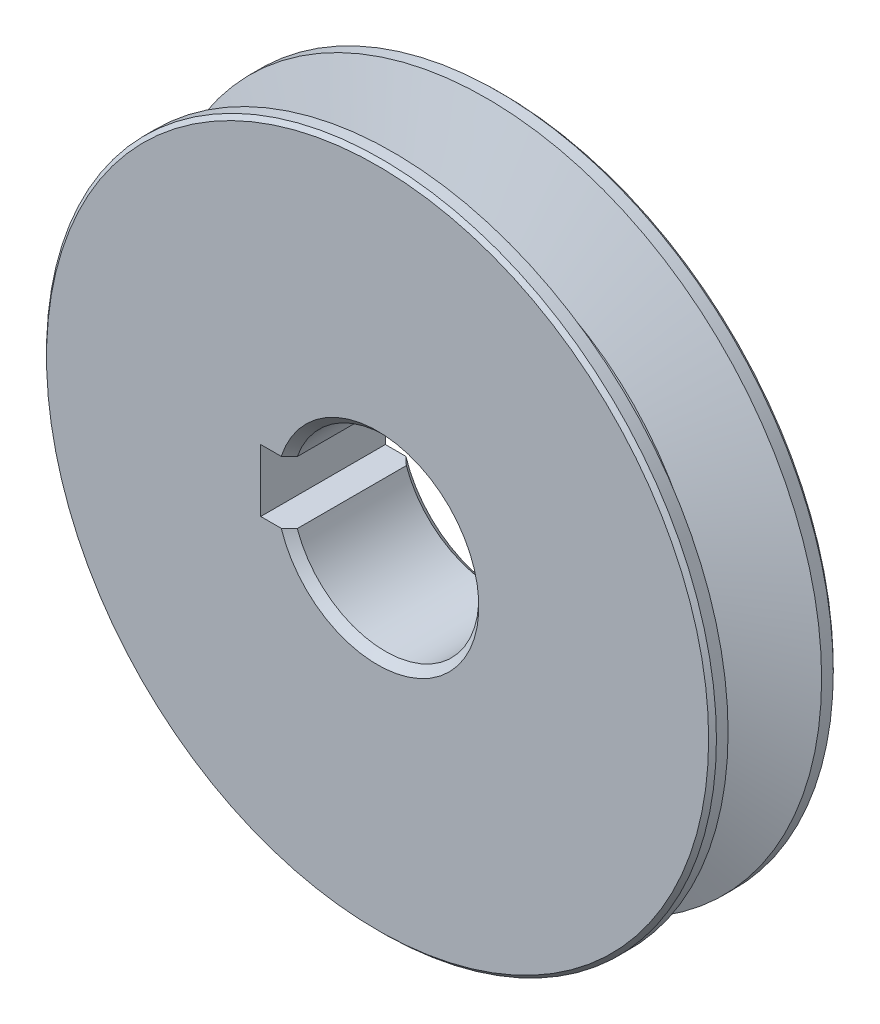
ISO-10303-21;
HEADER;
FILE_DESCRIPTION(('STEP AP214'),'2;1');
FILE_NAME('part.step','',(''),(''),'','','');
FILE_SCHEMA(('AUTOMOTIVE_DESIGN { 1 0 10303 214 1 1 1 1 }'));
ENDSEC;
DATA;
#1=APPLICATION_CONTEXT('core data for automotive mechanical design processes');
#2=APPLICATION_PROTOCOL_DEFINITION('international standard','automotive_design',2000,#1);
#3=PRODUCT_CONTEXT('',#1,'mechanical');
#4=PRODUCT('Part','Part','',(#3));
#5=PRODUCT_RELATED_PRODUCT_CATEGORY('part','',(#4));
#6=PRODUCT_DEFINITION_FORMATION('','',#4);
#7=PRODUCT_DEFINITION_CONTEXT('part definition',#1,'design');
#8=PRODUCT_DEFINITION('design','',#6,#7);
#9=PRODUCT_DEFINITION_SHAPE('','',#8);
#10=(LENGTH_UNIT() NAMED_UNIT(*) SI_UNIT(.MILLI.,.METRE.));
#11=(NAMED_UNIT(*) PLANE_ANGLE_UNIT() SI_UNIT($,.RADIAN.));
#12=(NAMED_UNIT(*) SI_UNIT($,.STERADIAN.) SOLID_ANGLE_UNIT());
#13=UNCERTAINTY_MEASURE_WITH_UNIT(LENGTH_MEASURE(1.E-05),#10,'distance_accuracy_value','');
#14=(GEOMETRIC_REPRESENTATION_CONTEXT(3) GLOBAL_UNCERTAINTY_ASSIGNED_CONTEXT((#13)) GLOBAL_UNIT_ASSIGNED_CONTEXT((#10,
#11,#12)) REPRESENTATION_CONTEXT('',''));
#15=CARTESIAN_POINT('',(0.,0.,0.));
#16=DIRECTION('',(0.,0.,1.));
#17=DIRECTION('',(1.,0.,0.));
#18=AXIS2_PLACEMENT_3D('',#15,#16,#17);
#19=CARTESIAN_POINT('',(0.02123051128702,9.01009597848504E-13,-5.99999999999978));
#20=DIRECTION('',(0.,0.,1.));
#21=DIRECTION('',(1.,0.,0.));
#22=AXIS2_PLACEMENT_3D('',#19,#20,#21);
#23=CYLINDRICAL_SURFACE('',#22,32.25);
#24=CARTESIAN_POINT('',(0.0212305112870201,9.01009597848504E-13,-5.62499999999969));
#25=DIRECTION('',(0.,0.,-1.));
#26=DIRECTION('',(-1.,0.,0.));
#27=AXIS2_PLACEMENT_3D('',#24,#25,#26);
#28=CIRCLE('',#27,32.25);
#29=CARTESIAN_POINT('',(-32.228769488713,9.01009597848504E-13,-5.62499999999969));
#30=VERTEX_POINT('',#29);
#31=EDGE_CURVE('E43',#30,#30,#28,.F.);
#32=ORIENTED_EDGE('',*,*,#31,.T.);
#33=EDGE_LOOP('',(#32));
#34=FACE_BOUND('',#33,.T.);
#35=CARTESIAN_POINT('',(0.0212305112870202,9.01009597848504E-13,-4.50275443269578));
#36=DIRECTION('',(0.,0.,1.));
#37=DIRECTION('',(1.,0.,0.));
#38=AXIS2_PLACEMENT_3D('',#35,#36,#37);
#39=CIRCLE('',#38,32.25);
#40=CARTESIAN_POINT('',(32.271230511287,9.01009597848504E-13,-4.50275443269578));
#41=VERTEX_POINT('',#40);
#42=EDGE_CURVE('E121',#41,#41,#39,.T.);
#43=ORIENTED_EDGE('',*,*,#42,.F.);
#44=EDGE_LOOP('',(#43));
#45=FACE_BOUND('',#44,.T.);
#46=ADVANCED_FACE('F35',(#34,#45),#23,.T.);
#47=CARTESIAN_POINT('',(32.271230511287,9.01009597848504E-13,-5.99999999999979));
#48=DIRECTION('',(0.,0.,-1.));
#49=DIRECTION('',(-1.,0.,0.));
#50=AXIS2_PLACEMENT_3D('',#47,#48,#49);
#51=PLANE('',#50);
#52=CARTESIAN_POINT('',(0.02123051128702,9.01009597848504E-13,-5.99999999999978));
#53=DIRECTION('',(0.,0.,-1.));
#54=DIRECTION('',(-1.,0.,0.));
#55=AXIS2_PLACEMENT_3D('',#52,#53,#54);
#56=CIRCLE('',#55,31.875);
#57=CARTESIAN_POINT('',(-31.853769488713,9.01009597848504E-13,-5.99999999999978));
#58=VERTEX_POINT('',#57);
#59=EDGE_CURVE('E11',#58,#58,#56,.T.);
#60=ORIENTED_EDGE('',*,*,#59,.T.);
#61=EDGE_LOOP('',(#60));
#62=FACE_BOUND('',#61,.T.);
#63=DIRECTION('',(1.,0.,0.));
#64=VECTOR('',#63,1.);
#65=CARTESIAN_POINT('',(-11.2287694887134,-2.9999999999991,-5.99999999999978));
#66=LINE('',#65,#64);
#67=CARTESIAN_POINT('',(-11.2287694887134,-2.9999999999991,-5.99999999999978));
#68=VERTEX_POINT('',#67);
#69=CARTESIAN_POINT('',(-9.25575716274696,-2.9999999999991,-5.99999999999978));
#70=VERTEX_POINT('',#69);
#71=EDGE_CURVE('E102',#68,#70,#66,.T.);
#72=ORIENTED_EDGE('',*,*,#71,.T.);
#73=CARTESIAN_POINT('',(0.0212305112866469,9.01009597848504E-13,-5.99999999999978));
#74=DIRECTION('',(0.,0.,-1.));
#75=DIRECTION('',(-1.,0.,0.));
#76=AXIS2_PLACEMENT_3D('',#73,#74,#75);
#77=CIRCLE('',#76,9.75000001559854);
#78=CARTESIAN_POINT('',(-9.25575716298804,2.9999999992554,-5.99999999999978));
#79=VERTEX_POINT('',#78);
#80=EDGE_CURVE('E181',#70,#79,#77,.F.);
#81=ORIENTED_EDGE('',*,*,#80,.T.);
#82=DIRECTION('',(-1.,0.,0.));
#83=VECTOR('',#82,1.);
#84=CARTESIAN_POINT('',(-8.4640508632155,2.9999999992554,-5.99999999999978));
#85=LINE('',#84,#83);
#86=CARTESIAN_POINT('',(-11.2287694887134,2.9999999992554,-5.99999999999978));
#87=VERTEX_POINT('',#86);
#88=EDGE_CURVE('E100',#79,#87,#85,.T.);
#89=ORIENTED_EDGE('',*,*,#88,.T.);
#90=DIRECTION('',(0.,-1.,0.));
#91=VECTOR('',#90,1.);
#92=CARTESIAN_POINT('',(-11.2287694887134,2.9999999992554,-5.99999999999978));
#93=LINE('',#92,#91);
#94=EDGE_CURVE('E96',#87,#68,#93,.T.);
#95=ORIENTED_EDGE('',*,*,#94,.T.);
#96=EDGE_LOOP('',(#72,#81,#89,#95));
#97=FACE_BOUND('',#96,.T.);
#98=ADVANCED_FACE('F108',(#62,#97),#51,.T.);
#99=CARTESIAN_POINT('',(0.0212305112870215,9.01009597848504E-13,6.00000000000022));
#100=DIRECTION('',(0.,0.,1.));
#101=DIRECTION('',(1.,0.,0.));
#102=AXIS2_PLACEMENT_3D('',#99,#100,#101);
#103=PLANE('',#102);
#104=CARTESIAN_POINT('',(0.0212305112870215,9.01009597848504E-13,6.00000000000022));
#105=DIRECTION('',(0.,0.,1.));
#106=DIRECTION('',(1.,0.,0.));
#107=AXIS2_PLACEMENT_3D('',#104,#105,#106);
#108=CIRCLE('',#107,31.8749999999999);
#109=CARTESIAN_POINT('',(31.8962305112869,9.01009597848504E-13,6.00000000000022));
#110=VERTEX_POINT('',#109);
#111=EDGE_CURVE('E328',#110,#110,#108,.T.);
#112=ORIENTED_EDGE('',*,*,#111,.T.);
#113=EDGE_LOOP('',(#112));
#114=FACE_BOUND('',#113,.T.);
#115=DIRECTION('',(-1.,0.,0.));
#116=VECTOR('',#115,1.);
#117=CARTESIAN_POINT('',(-8.4640508632155,2.9999999992554,6.00000000000022));
#118=LINE('',#117,#116);
#119=CARTESIAN_POINT('',(-9.2557571609674,2.9999999992554,6.00000000000022));
#120=VERTEX_POINT('',#119);
#121=CARTESIAN_POINT('',(-11.2287694887134,2.9999999992554,6.00000000000022));
#122=VERTEX_POINT('',#121);
#123=EDGE_CURVE('E111',#120,#122,#118,.T.);
#124=ORIENTED_EDGE('',*,*,#123,.F.);
#125=CARTESIAN_POINT('',(0.0212305112866469,9.01009597848504E-13,6.00000000000022));
#126=DIRECTION('',(0.,0.,1.));
#127=DIRECTION('',(1.,0.,0.));
#128=AXIS2_PLACEMENT_3D('',#125,#126,#127);
#129=CIRCLE('',#128,9.75000001367592);
#130=CARTESIAN_POINT('',(-9.25575716072631,-2.9999999999991,6.00000000000022));
#131=VERTEX_POINT('',#130);
#132=EDGE_CURVE('E58',#120,#131,#129,.F.);
#133=ORIENTED_EDGE('',*,*,#132,.T.);
#134=DIRECTION('',(1.,0.,0.));
#135=VECTOR('',#134,1.);
#136=CARTESIAN_POINT('',(-11.2287694887134,-2.9999999999991,6.00000000000022));
#137=LINE('',#136,#135);
#138=CARTESIAN_POINT('',(-11.2287694887134,-2.9999999999991,6.00000000000022));
#139=VERTEX_POINT('',#138);
#140=EDGE_CURVE('E113',#139,#131,#137,.T.);
#141=ORIENTED_EDGE('',*,*,#140,.F.);
#142=DIRECTION('',(0.,-1.,0.));
#143=VECTOR('',#142,1.);
#144=CARTESIAN_POINT('',(-11.2287694887134,2.9999999992554,6.00000000000022));
#145=LINE('',#144,#143);
#146=EDGE_CURVE('E98',#122,#139,#145,.T.);
#147=ORIENTED_EDGE('',*,*,#146,.F.);
#148=EDGE_LOOP('',(#124,#133,#141,#147));
#149=FACE_BOUND('',#148,.T.);
#150=ADVANCED_FACE('F194',(#114,#149),#103,.T.);
#151=CARTESIAN_POINT('',(0.02123051128702,9.01009597848504E-13,-5.99999999999978));
#152=DIRECTION('',(0.,0.,1.));
#153=DIRECTION('',(1.,0.,0.));
#154=AXIS2_PLACEMENT_3D('',#151,#152,#153);
#155=CYLINDRICAL_SURFACE('',#154,32.25);
#156=CARTESIAN_POINT('',(0.0212305112870214,9.01009597848504E-13,5.62500000000025));
#157=DIRECTION('',(0.,0.,1.));
#158=DIRECTION('',(1.,0.,0.));
#159=AXIS2_PLACEMENT_3D('',#156,#157,#158);
#160=CIRCLE('',#159,32.25);
#161=CARTESIAN_POINT('',(32.271230511287,9.01009597848504E-13,5.62500000000025));
#162=VERTEX_POINT('',#161);
#163=EDGE_CURVE('E326',#162,#162,#160,.F.);
#164=ORIENTED_EDGE('',*,*,#163,.T.);
#165=EDGE_LOOP('',(#164));
#166=FACE_BOUND('',#165,.T.);
#167=CARTESIAN_POINT('',(0.0212305112870213,9.01009597848504E-13,4.50275443269622));
#168=DIRECTION('',(0.,0.,1.));
#169=DIRECTION('',(1.,0.,0.));
#170=AXIS2_PLACEMENT_3D('',#167,#168,#169);
#171=CIRCLE('',#170,32.25);
#172=CARTESIAN_POINT('',(32.271230511287,9.01009597848504E-13,4.50275443269622));
#173=VERTEX_POINT('',#172);
#174=EDGE_CURVE('E135',#173,#173,#171,.T.);
#175=ORIENTED_EDGE('',*,*,#174,.T.);
#176=EDGE_LOOP('',(#175));
#177=FACE_BOUND('',#176,.T.);
#178=ADVANCED_FACE('F198',(#166,#177),#155,.T.);
#179=CARTESIAN_POINT('',(0.0212305112870213,9.01009597848504E-13,4.50275443269622));
#180=DIRECTION('',(0.,0.,1.));
#181=DIRECTION('',(1.,0.,0.));
#182=AXIS2_PLACEMENT_3D('',#179,#180,#181);
#183=CONICAL_SURFACE('',#182,32.25,1.22173047639594);
#184=CARTESIAN_POINT('',(0.0212305112870209,9.01009597848504E-13,1.4999999999992));
#185=DIRECTION('',(0.,0.,1.));
#186=DIRECTION('',(1.,0.,0.));
#187=AXIS2_PLACEMENT_3D('',#184,#185,#186);
#188=CIRCLE('',#187,24.);
#189=CARTESIAN_POINT('',(24.021230511287,9.01009597848504E-13,1.49999999999919));
#190=VERTEX_POINT('',#189);
#191=EDGE_CURVE('E132',#190,#190,#188,.T.);
#192=ORIENTED_EDGE('',*,*,#191,.T.);
#193=EDGE_LOOP('',(#192));
#194=FACE_BOUND('',#193,.T.);
#195=ORIENTED_EDGE('',*,*,#174,.F.);
#196=EDGE_LOOP('',(#195));
#197=FACE_BOUND('',#196,.T.);
#198=ADVANCED_FACE('F202',(#194,#197),#183,.T.);
#199=CARTESIAN_POINT('',(0.02123051128702,9.01009597848504E-13,-5.99999999999978));
#200=DIRECTION('',(0.,0.,1.));
#201=DIRECTION('',(1.,0.,0.));
#202=AXIS2_PLACEMENT_3D('',#199,#200,#201);
#203=CYLINDRICAL_SURFACE('',#202,24.);
#204=CARTESIAN_POINT('',(0.0212305112870206,9.01009597848504E-13,-1.49999999999978));
#205=DIRECTION('',(0.,0.,1.));
#206=DIRECTION('',(1.,0.,0.));
#207=AXIS2_PLACEMENT_3D('',#204,#205,#206);
#208=CIRCLE('',#207,24.);
#209=CARTESIAN_POINT('',(24.021230511287,9.01009597848504E-13,-1.49999999999978));
#210=VERTEX_POINT('',#209);
#211=EDGE_CURVE('E129',#210,#210,#208,.T.);
#212=ORIENTED_EDGE('',*,*,#211,.T.);
#213=EDGE_LOOP('',(#212));
#214=FACE_BOUND('',#213,.T.);
#215=ORIENTED_EDGE('',*,*,#191,.F.);
#216=EDGE_LOOP('',(#215));
#217=FACE_BOUND('',#216,.T.);
#218=ADVANCED_FACE('F206',(#214,#217),#203,.T.);
#219=CARTESIAN_POINT('',(0.0212305112870206,9.01009597848504E-13,-1.49999999999978));
#220=DIRECTION('',(0.,0.,-1.));
#221=DIRECTION('',(-1.,0.,0.));
#222=AXIS2_PLACEMENT_3D('',#219,#220,#221);
#223=CONICAL_SURFACE('',#222,24.,1.22173047639605);
#224=ORIENTED_EDGE('',*,*,#42,.T.);
#225=EDGE_LOOP('',(#224));
#226=FACE_BOUND('',#225,.T.);
#227=ORIENTED_EDGE('',*,*,#211,.F.);
#228=EDGE_LOOP('',(#227));
#229=FACE_BOUND('',#228,.T.);
#230=ADVANCED_FACE('F209',(#226,#229),#223,.T.);
#231=CARTESIAN_POINT('',(-11.2287694887134,2.9999999992554,-5.99999999999978));
#232=DIRECTION('',(-1.,0.,0.));
#233=DIRECTION('',(0.,0.,1.));
#234=AXIS2_PLACEMENT_3D('',#231,#232,#233);
#235=PLANE('',#234);
#236=ORIENTED_EDGE('',*,*,#146,.T.);
#237=DIRECTION('',(0.,0.,1.));
#238=VECTOR('',#237,1.);
#239=CARTESIAN_POINT('',(-11.2287694887134,-2.9999999999991,-5.99999999999978));
#240=LINE('',#239,#238);
#241=EDGE_CURVE('E92',#68,#139,#240,.T.);
#242=ORIENTED_EDGE('',*,*,#241,.F.);
#243=ORIENTED_EDGE('',*,*,#94,.F.);
#244=DIRECTION('',(0.,0.,1.));
#245=VECTOR('',#244,1.);
#246=CARTESIAN_POINT('',(-11.2287694887134,2.9999999992554,-5.99999999999978));
#247=LINE('',#246,#245);
#248=EDGE_CURVE('E119',#87,#122,#247,.T.);
#249=ORIENTED_EDGE('',*,*,#248,.T.);
#250=EDGE_LOOP('',(#236,#242,#243,#249));
#251=FACE_BOUND('',#250,.T.);
#252=ADVANCED_FACE('F93',(#251),#235,.F.);
#253=CARTESIAN_POINT('',(-8.4640508632155,2.9999999992554,-5.99999999999978));
#254=DIRECTION('',(0.,1.,0.));
#255=DIRECTION('',(0.,0.,1.));
#256=AXIS2_PLACEMENT_3D('',#253,#254,#255);
#257=PLANE('',#256);
#258=DIRECTION('',(0.,0.,1.));
#259=VECTOR('',#258,1.);
#260=CARTESIAN_POINT('',(-8.46405086321549,2.9999999992554,-5.99999999999978));
#261=LINE('',#260,#259);
#262=CARTESIAN_POINT('',(-8.46405086321549,2.9999999992554,-5.24999998632386));
#263=VERTEX_POINT('',#262);
#264=CARTESIAN_POINT('',(-8.46405086321549,2.9999999992554,5.24999998440168));
#265=VERTEX_POINT('',#264);
#266=EDGE_CURVE('E122',#263,#265,#261,.T.);
#267=ORIENTED_EDGE('',*,*,#266,.T.);
#268=CARTESIAN_POINT('',(-8.4640508632155,2.9999999992554,5.24999998440168));
#269=CARTESIAN_POINT('',(-8.59628727510804,2.9999999992554,5.37469876997658));
#270=CARTESIAN_POINT('',(-8.72838100929807,2.9999999992554,5.49954816732916));
#271=CARTESIAN_POINT('',(-8.99228310851896,2.9999999992554,5.74954817256007));
#272=CARTESIAN_POINT('',(-9.12409147357956,2.9999999992554,5.874698780407));
#273=CARTESIAN_POINT('',(-9.2557571609674,2.9999999992554,6.00000000000022));
#274=B_SPLINE_CURVE_WITH_KNOTS('',3,(#268,#269,#270,#271,#272,#273),.UNSPECIFIED.,.F.,.F.,(4,2,
4),(0.,0.545275287982242,1.09055051912671),.UNSPECIFIED.);
#275=EDGE_CURVE('E150',#265,#120,#274,.T.);
#276=ORIENTED_EDGE('',*,*,#275,.T.);
#277=ORIENTED_EDGE('',*,*,#123,.T.);
#278=ORIENTED_EDGE('',*,*,#248,.F.);
#279=ORIENTED_EDGE('',*,*,#88,.F.);
#280=CARTESIAN_POINT('',(-9.25575716298804,2.9999999992554,-5.99999999999978));
#281=CARTESIAN_POINT('',(-9.12409147526326,2.9999999992554,-5.87469878072564));
#282=CARTESIAN_POINT('',(-8.9922831098658,2.9999999992554,-5.74954817319845));
#283=CARTESIAN_POINT('',(-8.72838100997136,2.9999999992554,-5.49954816860841));
#284=CARTESIAN_POINT('',(-8.59628727544464,2.9999999992554,-5.37469877157695));
#285=CARTESIAN_POINT('',(-8.4640508632155,2.9999999992554,-5.24999998632386));
#286=B_SPLINE_CURVE_WITH_KNOTS('',3,(#280,#281,#282,#283,#284,#285),.UNSPECIFIED.,.F.,.F.,(4,2,
4),(0.,0.545275231216821,1.09055051927141),.UNSPECIFIED.);
#287=EDGE_CURVE('E143',#79,#263,#286,.T.);
#288=ORIENTED_EDGE('',*,*,#287,.T.);
#289=EDGE_LOOP('',(#267,#276,#277,#278,#279,#288));
#290=FACE_BOUND('',#289,.T.);
#291=ADVANCED_FACE('F158',(#290),#257,.F.);
#292=CARTESIAN_POINT('',(-11.2287694887134,-2.9999999999991,-5.99999999999978));
#293=DIRECTION('',(0.,-1.,0.));
#294=DIRECTION('',(0.,0.,-1.));
#295=AXIS2_PLACEMENT_3D('',#292,#293,#294);
#296=PLANE('',#295);
#297=ORIENTED_EDGE('',*,*,#140,.T.);
#298=CARTESIAN_POINT('',(-9.25575716072631,-2.9999999999991,6.00000000000022));
#299=CARTESIAN_POINT('',(-9.12409147333489,-2.9999999999991,5.87469878040683));
#300=CARTESIAN_POINT('',(-8.99228310827062,-2.9999999999991,5.7495481725598));
#301=CARTESIAN_POINT('',(-8.72838100904223,-2.9999999999991,5.49954816732889));
#302=CARTESIAN_POINT('',(-8.59628727484837,-2.9999999999991,5.3746987699764));
#303=CARTESIAN_POINT('',(-8.46405086295192,-2.9999999999991,5.24999998440168));
#304=B_SPLINE_CURVE_WITH_KNOTS('',3,(#298,#299,#300,#301,#302,#303),.UNSPECIFIED.,.F.,.F.,(4,2,
4),(0.,0.545275231152638,1.09055051914304),.UNSPECIFIED.);
#305=CARTESIAN_POINT('',(-8.46405086295192,-2.9999999999991,5.24999998440168));
#306=VERTEX_POINT('',#305);
#307=EDGE_CURVE('E176',#131,#306,#304,.T.);
#308=ORIENTED_EDGE('',*,*,#307,.T.);
#309=DIRECTION('',(0.,0.,1.));
#310=VECTOR('',#309,1.);
#311=CARTESIAN_POINT('',(-8.46405086295192,-2.9999999999991,-5.99999999999978));
#312=LINE('',#311,#310);
#313=CARTESIAN_POINT('',(-8.46405086295192,-2.9999999999991,-5.24999998632386));
#314=VERTEX_POINT('',#313);
#315=EDGE_CURVE('E99',#314,#306,#312,.T.);
#316=ORIENTED_EDGE('',*,*,#315,.F.);
#317=CARTESIAN_POINT('',(-8.46405086295192,-2.9999999999991,-5.24999998632386));
#318=CARTESIAN_POINT('',(-8.59628727518497,-2.9999999999991,-5.37469877157678));
#319=CARTESIAN_POINT('',(-8.72838100971552,-2.9999999999991,-5.49954816860815));
#320=CARTESIAN_POINT('',(-8.99228310961746,-2.9999999999991,-5.74954817319819));
#321=CARTESIAN_POINT('',(-9.12409147501859,-2.9999999999991,-5.87469878072546));
#322=CARTESIAN_POINT('',(-9.25575716274696,-2.9999999999991,-5.99999999999978));
#323=B_SPLINE_CURVE_WITH_KNOTS('',3,(#317,#318,#319,#320,#321,#322),.UNSPECIFIED.,.F.,.F.,(4,2,
4),(0.,0.545275288062756,1.09055051928774),.UNSPECIFIED.);
#324=EDGE_CURVE('E50',#314,#70,#323,.T.);
#325=ORIENTED_EDGE('',*,*,#324,.T.);
#326=ORIENTED_EDGE('',*,*,#71,.F.);
#327=ORIENTED_EDGE('',*,*,#241,.T.);
#328=EDGE_LOOP('',(#297,#308,#316,#325,#326,#327));
#329=FACE_BOUND('',#328,.T.);
#330=ADVANCED_FACE('F103',(#329),#296,.F.);
#331=CARTESIAN_POINT('',(0.0212305112866469,9.01009597848504E-13,-5.99999999999978));
#332=DIRECTION('',(0.,0.,1.));
#333=DIRECTION('',(1.,0.,0.));
#334=AXIS2_PLACEMENT_3D('',#331,#332,#333);
#335=CYLINDRICAL_SURFACE('',#334,9.);
#336=ORIENTED_EDGE('',*,*,#315,.T.);
#337=CARTESIAN_POINT('',(0.0212305112866469,9.01009597848504E-13,5.24999998440168));
#338=DIRECTION('',(0.,0.,1.));
#339=DIRECTION('',(1.,0.,0.));
#340=AXIS2_PLACEMENT_3D('',#337,#338,#339);
#341=CIRCLE('',#340,9.);
#342=EDGE_CURVE('E140',#306,#265,#341,.T.);
#343=ORIENTED_EDGE('',*,*,#342,.T.);
#344=ORIENTED_EDGE('',*,*,#266,.F.);
#345=CARTESIAN_POINT('',(0.0212305112866469,9.01009597848504E-13,-5.24999998632386));
#346=DIRECTION('',(0.,0.,-1.));
#347=DIRECTION('',(-1.,0.,0.));
#348=AXIS2_PLACEMENT_3D('',#345,#346,#347);
#349=CIRCLE('',#348,9.);
#350=EDGE_CURVE('E138',#263,#314,#349,.T.);
#351=ORIENTED_EDGE('',*,*,#350,.T.);
#352=EDGE_LOOP('',(#336,#343,#344,#351));
#353=FACE_BOUND('',#352,.T.);
#354=ADVANCED_FACE('F164',(#353),#335,.F.);
#355=CARTESIAN_POINT('',(0.0212305112866469,9.01009597848504E-13,5.24999998440168));
#356=DIRECTION('',(0.,0.,1.));
#357=DIRECTION('',(1.,0.,0.));
#358=AXIS2_PLACEMENT_3D('',#355,#356,#357);
#359=CONICAL_SURFACE('',#358,9.,0.785398162115705);
#360=ORIENTED_EDGE('',*,*,#307,.F.);
#361=ORIENTED_EDGE('',*,*,#132,.F.);
#362=ORIENTED_EDGE('',*,*,#275,.F.);
#363=ORIENTED_EDGE('',*,*,#342,.F.);
#364=EDGE_LOOP('',(#360,#361,#362,#363));
#365=FACE_BOUND('',#364,.T.);
#366=ADVANCED_FACE('F183',(#365),#359,.F.);
#367=CARTESIAN_POINT('',(0.0212305112866469,9.01009597848504E-13,-5.99999999999978));
#368=DIRECTION('',(0.,0.,-1.));
#369=DIRECTION('',(-1.,0.,0.));
#370=AXIS2_PLACEMENT_3D('',#367,#368,#369);
#371=CONICAL_SURFACE('',#370,9.75000001559854,0.785398164679191);
#372=ORIENTED_EDGE('',*,*,#324,.F.);
#373=ORIENTED_EDGE('',*,*,#350,.F.);
#374=ORIENTED_EDGE('',*,*,#287,.F.);
#375=ORIENTED_EDGE('',*,*,#80,.F.);
#376=EDGE_LOOP('',(#372,#373,#374,#375));
#377=FACE_BOUND('',#376,.T.);
#378=ADVANCED_FACE('F156',(#377),#371,.F.);
#379=CARTESIAN_POINT('',(0.0212305112870215,9.01009597848504E-13,6.00000000000022));
#380=DIRECTION('',(0.,0.,-1.));
#381=DIRECTION('',(-1.,0.,0.));
#382=AXIS2_PLACEMENT_3D('',#379,#380,#381);
#383=CONICAL_SURFACE('',#382,31.8749999999999,0.785398163397601);
#384=ORIENTED_EDGE('',*,*,#163,.F.);
#385=EDGE_LOOP('',(#384));
#386=FACE_BOUND('',#385,.T.);
#387=ORIENTED_EDGE('',*,*,#111,.F.);
#388=EDGE_LOOP('',(#387));
#389=FACE_BOUND('',#388,.T.);
#390=ADVANCED_FACE('F251',(#386,#389),#383,.T.);
#391=CARTESIAN_POINT('',(0.0212305112870201,9.01009597848504E-13,-5.62499999999969));
#392=DIRECTION('',(0.,0.,1.));
#393=DIRECTION('',(1.,0.,0.));
#394=AXIS2_PLACEMENT_3D('',#391,#392,#393);
#395=CONICAL_SURFACE('',#394,32.25,0.785398163397303);
#396=ORIENTED_EDGE('',*,*,#59,.F.);
#397=EDGE_LOOP('',(#396));
#398=FACE_BOUND('',#397,.T.);
#399=ORIENTED_EDGE('',*,*,#31,.F.);
#400=EDGE_LOOP('',(#399));
#401=FACE_BOUND('',#400,.T.);
#402=ADVANCED_FACE('F37',(#398,#401),#395,.T.);
#403=CLOSED_SHELL('',(#46,#98,#150,#178,#198,#218,#230,#252,#291,#330,#354,#366,#378,#390,#402));
#404=MANIFOLD_SOLID_BREP('B2',#403);
#405=ADVANCED_BREP_SHAPE_REPRESENTATION('',(#18,#404),#14);
#406=SHAPE_DEFINITION_REPRESENTATION(#9,#405);
ENDSEC;
END-ISO-10303-21;
